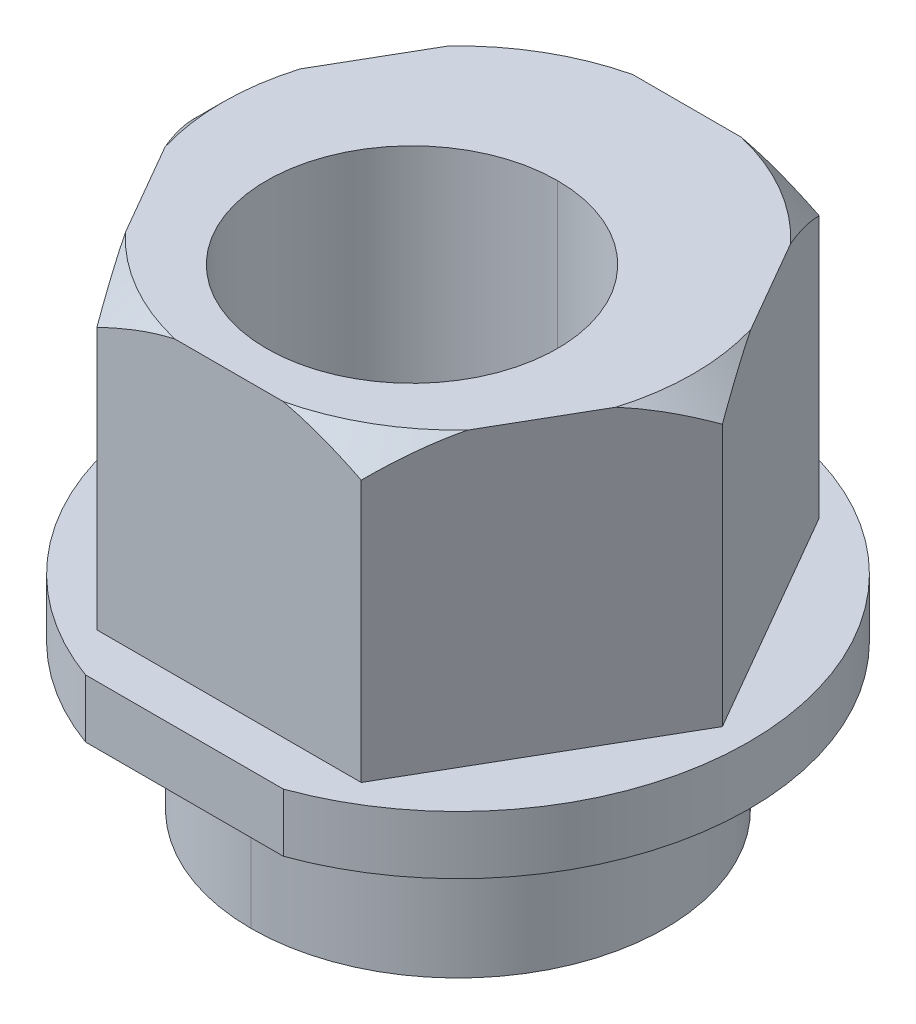
ISO-10303-21;
HEADER;
FILE_DESCRIPTION(('STEP AP214'),'2;1');
FILE_NAME('part.step','',(''),(''),'','','');
FILE_SCHEMA(('AUTOMOTIVE_DESIGN { 1 0 10303 214 1 1 1 1 }'));
ENDSEC;
DATA;
#1=APPLICATION_CONTEXT('core data for automotive mechanical design processes');
#2=APPLICATION_PROTOCOL_DEFINITION('international standard','automotive_design',2000,#1);
#3=PRODUCT_CONTEXT('',#1,'mechanical');
#4=PRODUCT('Part','Part','',(#3));
#5=PRODUCT_RELATED_PRODUCT_CATEGORY('part','',(#4));
#6=PRODUCT_DEFINITION_FORMATION('','',#4);
#7=PRODUCT_DEFINITION_CONTEXT('part definition',#1,'design');
#8=PRODUCT_DEFINITION('design','',#6,#7);
#9=PRODUCT_DEFINITION_SHAPE('','',#8);
#10=(LENGTH_UNIT() NAMED_UNIT(*) SI_UNIT(.MILLI.,.METRE.));
#11=(NAMED_UNIT(*) PLANE_ANGLE_UNIT() SI_UNIT($,.RADIAN.));
#12=(NAMED_UNIT(*) SI_UNIT($,.STERADIAN.) SOLID_ANGLE_UNIT());
#13=UNCERTAINTY_MEASURE_WITH_UNIT(LENGTH_MEASURE(1.E-05),#10,'distance_accuracy_value','');
#14=(GEOMETRIC_REPRESENTATION_CONTEXT(3) GLOBAL_UNCERTAINTY_ASSIGNED_CONTEXT((#13)) GLOBAL_UNIT_ASSIGNED_CONTEXT((#10,
#11,#12)) REPRESENTATION_CONTEXT('',''));
#15=CARTESIAN_POINT('',(0.,0.,0.));
#16=DIRECTION('',(0.,0.,1.));
#17=DIRECTION('',(1.,0.,0.));
#18=AXIS2_PLACEMENT_3D('',#15,#16,#17);
#19=CARTESIAN_POINT('',(0.,5.,0.));
#20=DIRECTION('',(0.,-1.,0.));
#21=DIRECTION('',(0.,0.,-1.));
#22=AXIS2_PLACEMENT_3D('',#19,#20,#21);
#23=CONICAL_SURFACE('',#22,4.04374661852235,0.785398163397448);
#24=CARTESIAN_POINT('',(-0.931483609523519,5.,3.935));
#25=CARTESIAN_POINT('',(-1.56265689446236,4.8546082073994,3.935));
#26=CARTESIAN_POINT('',(-2.27187330926117,4.5,3.935));
#27=B_SPLINE_CURVE_WITH_KNOTS('',2,(#24,#25,#26),.UNSPECIFIED.,.F.,.F.,(3,3),(0.,1.),.UNSPECIFIED.);
#28=CARTESIAN_POINT('',(-0.931483609523519,5.,3.935));
#29=VERTEX_POINT('',#28);
#30=CARTESIAN_POINT('',(-2.27187330926118,4.5,3.935));
#31=VERTEX_POINT('',#30);
#32=EDGE_CURVE('E227',#29,#31,#27,.T.);
#33=ORIENTED_EDGE('',*,*,#32,.F.);
#34=CARTESIAN_POINT('',(0.,5.,0.));
#35=DIRECTION('',(0.,-1.,0.));
#36=DIRECTION('',(0.,0.,1.));
#37=AXIS2_PLACEMENT_3D('',#34,#35,#36);
#38=CIRCLE('',#37,4.04374661852235);
#39=CARTESIAN_POINT('',(-2.94206815913001,5.,2.77418846905619));
#40=VERTEX_POINT('',#39);
#41=EDGE_CURVE('E226',#29,#40,#38,.T.);
#42=ORIENTED_EDGE('',*,*,#41,.T.);
#43=CARTESIAN_POINT('',(-2.27187330926117,4.5,3.93500000000001));
#44=CARTESIAN_POINT('',(-2.62648151666057,4.85460820739939,3.32080056800333));
#45=CARTESIAN_POINT('',(-2.94206815913,5.,2.7741884690562));
#46=B_SPLINE_CURVE_WITH_KNOTS('',2,(#43,#44,#45),.UNSPECIFIED.,.F.,.F.,(3,3),(0.,1.),.UNSPECIFIED.);
#47=EDGE_CURVE('E581',#31,#40,#46,.T.);
#48=ORIENTED_EDGE('',*,*,#47,.F.);
#49=EDGE_LOOP('',(#33,#42,#48));
#50=FACE_BOUND('',#49,.T.);
#51=ADVANCED_FACE('F16',(#50),#23,.T.);
#52=CARTESIAN_POINT('',(0.,5.,0.));
#53=DIRECTION('',(0.,-1.,0.));
#54=DIRECTION('',(0.,0.,-1.));
#55=AXIS2_PLACEMENT_3D('',#52,#53,#54);
#56=CONICAL_SURFACE('',#55,4.04374661852235,0.785398163397448);
#57=CARTESIAN_POINT('',(-3.87355176865352,5.,1.16081153094381));
#58=CARTESIAN_POINT('',(-4.189138411123,4.8546082073994,0.614199431996595));
#59=CARTESIAN_POINT('',(-4.54374661852235,4.5,0.));
#60=B_SPLINE_CURVE_WITH_KNOTS('',2,(#57,#58,#59),.UNSPECIFIED.,.F.,.F.,(3,3),(0.,1.),.UNSPECIFIED.);
#61=CARTESIAN_POINT('',(-3.87355176865353,5.,1.16081153094381));
#62=VERTEX_POINT('',#61);
#63=CARTESIAN_POINT('',(-4.54374661852235,4.5,0.));
#64=VERTEX_POINT('',#63);
#65=EDGE_CURVE('E202',#62,#64,#60,.T.);
#66=ORIENTED_EDGE('',*,*,#65,.F.);
#67=CARTESIAN_POINT('',(0.,5.,0.));
#68=DIRECTION('',(0.,-1.,0.));
#69=DIRECTION('',(0.,0.,1.));
#70=AXIS2_PLACEMENT_3D('',#67,#68,#69);
#71=CIRCLE('',#70,4.04374661852235);
#72=CARTESIAN_POINT('',(-3.87355176865353,5.,-1.1608115309438));
#73=VERTEX_POINT('',#72);
#74=EDGE_CURVE('E256',#62,#73,#71,.T.);
#75=ORIENTED_EDGE('',*,*,#74,.T.);
#76=CARTESIAN_POINT('',(-4.54374661852235,4.5,0.));
#77=CARTESIAN_POINT('',(-4.18913841112296,4.85460820739939,-0.614199431996668));
#78=CARTESIAN_POINT('',(-3.87355176865352,5.,-1.1608115309438));
#79=B_SPLINE_CURVE_WITH_KNOTS('',2,(#76,#77,#78),.UNSPECIFIED.,.F.,.F.,(3,3),(0.,1.),.UNSPECIFIED.);
#80=EDGE_CURVE('E416',#64,#73,#79,.T.);
#81=ORIENTED_EDGE('',*,*,#80,.F.);
#82=EDGE_LOOP('',(#66,#75,#81));
#83=FACE_BOUND('',#82,.T.);
#84=ADVANCED_FACE('F295',(#83),#56,.T.);
#85=CARTESIAN_POINT('',(0.,5.,0.));
#86=DIRECTION('',(0.,-1.,0.));
#87=DIRECTION('',(0.,0.,-1.));
#88=AXIS2_PLACEMENT_3D('',#85,#86,#87);
#89=CONICAL_SURFACE('',#88,4.04374661852235,0.785398163397448);
#90=CARTESIAN_POINT('',(-2.94206815913,5.,-2.7741884690562));
#91=CARTESIAN_POINT('',(-2.62648151666052,4.85460820739939,-3.32080056800342));
#92=CARTESIAN_POINT('',(-2.27187330926117,4.5,-3.935));
#93=B_SPLINE_CURVE_WITH_KNOTS('',2,(#90,#91,#92),.UNSPECIFIED.,.F.,.F.,(3,3),(0.,1.),.UNSPECIFIED.);
#94=CARTESIAN_POINT('',(-2.94206815913,5.,-2.7741884690562));
#95=VERTEX_POINT('',#94);
#96=CARTESIAN_POINT('',(-2.27187330926118,4.5,-3.935));
#97=VERTEX_POINT('',#96);
#98=EDGE_CURVE('E267',#95,#97,#93,.T.);
#99=ORIENTED_EDGE('',*,*,#98,.F.);
#100=CARTESIAN_POINT('',(0.,5.,0.));
#101=DIRECTION('',(0.,-1.,0.));
#102=DIRECTION('',(0.,0.,1.));
#103=AXIS2_PLACEMENT_3D('',#100,#101,#102);
#104=CIRCLE('',#103,4.04374661852235);
#105=CARTESIAN_POINT('',(-0.931483609523527,5.,-3.935));
#106=VERTEX_POINT('',#105);
#107=EDGE_CURVE('E441',#95,#106,#104,.T.);
#108=ORIENTED_EDGE('',*,*,#107,.T.);
#109=CARTESIAN_POINT('',(-2.27187330926118,4.5,-3.935));
#110=CARTESIAN_POINT('',(-2.05765354420189,4.60710988252965,-3.935));
#111=CARTESIAN_POINT('',(-1.83776180733292,4.7056620232674,-3.935));
#112=CARTESIAN_POINT('',(-1.39148615565716,4.87507258275483,-3.935));
#113=CARTESIAN_POINT('',(-1.16421686751143,4.94638951555142,-3.935));
#114=CARTESIAN_POINT('',(-0.931483609523527,5.,-3.935));
#115=(BOUNDED_CURVE() B_SPLINE_CURVE(3,(#109,#110,#111,#112,#113,#114),.UNSPECIFIED.,.F.,
.F.) B_SPLINE_CURVE_WITH_KNOTS((4,2,4),(0.00329753197333184,0.00401123106866075,
0.00472493016398966),
.UNSPECIFIED.) CURVE() GEOMETRIC_REPRESENTATION_ITEM() RATIONAL_B_SPLINE_CURVE((1.,1.,1.,1.,1.,1.)) REPRESENTATION_ITEM(''));
#116=EDGE_CURVE('E421',#97,#106,#115,.T.);
#117=ORIENTED_EDGE('',*,*,#116,.F.);
#118=EDGE_LOOP('',(#99,#108,#117));
#119=FACE_BOUND('',#118,.T.);
#120=ADVANCED_FACE('F298',(#119),#89,.T.);
#121=CARTESIAN_POINT('',(0.,5.,0.));
#122=DIRECTION('',(0.,-1.,0.));
#123=DIRECTION('',(0.,0.,-1.));
#124=AXIS2_PLACEMENT_3D('',#121,#122,#123);
#125=CONICAL_SURFACE('',#124,4.04374661852235,0.785398163397448);
#126=CARTESIAN_POINT('',(0.931483609523525,5.,-3.935));
#127=CARTESIAN_POINT('',(1.56265689446236,4.85460820739941,-3.935));
#128=CARTESIAN_POINT('',(2.27187330926118,4.5,-3.935));
#129=B_SPLINE_CURVE_WITH_KNOTS('',2,(#126,#127,#128),.UNSPECIFIED.,.F.,.F.,(3,3),(0.,1.),.UNSPECIFIED.);
#130=CARTESIAN_POINT('',(0.931483609523526,5.,-3.935));
#131=VERTEX_POINT('',#130);
#132=CARTESIAN_POINT('',(2.27187330926118,4.5,-3.935));
#133=VERTEX_POINT('',#132);
#134=EDGE_CURVE('E233',#131,#133,#129,.T.);
#135=ORIENTED_EDGE('',*,*,#134,.F.);
#136=CARTESIAN_POINT('',(0.,5.,0.));
#137=DIRECTION('',(0.,-1.,0.));
#138=DIRECTION('',(0.,0.,-1.));
#139=AXIS2_PLACEMENT_3D('',#136,#137,#138);
#140=CIRCLE('',#139,4.04374661852235);
#141=CARTESIAN_POINT('',(2.94206815913,5.,-2.7741884690562));
#142=VERTEX_POINT('',#141);
#143=EDGE_CURVE('E443',#131,#142,#140,.T.);
#144=ORIENTED_EDGE('',*,*,#143,.T.);
#145=CARTESIAN_POINT('',(2.27187330926118,4.5,-3.93499999999999));
#146=CARTESIAN_POINT('',(2.62648151666057,4.85460820739939,-3.32080056800333));
#147=CARTESIAN_POINT('',(2.94206815913,5.,-2.7741884690562));
#148=B_SPLINE_CURVE_WITH_KNOTS('',2,(#145,#146,#147),.UNSPECIFIED.,.F.,.F.,(3,3),(0.,1.),.UNSPECIFIED.);
#149=EDGE_CURVE('E518',#133,#142,#148,.T.);
#150=ORIENTED_EDGE('',*,*,#149,.F.);
#151=EDGE_LOOP('',(#135,#144,#150));
#152=FACE_BOUND('',#151,.T.);
#153=ADVANCED_FACE('F292',(#152),#125,.T.);
#154=CARTESIAN_POINT('',(0.,5.,0.));
#155=DIRECTION('',(0.,-1.,0.));
#156=DIRECTION('',(0.,0.,-1.));
#157=AXIS2_PLACEMENT_3D('',#154,#155,#156);
#158=CONICAL_SURFACE('',#157,4.04374661852235,0.785398163397448);
#159=CARTESIAN_POINT('',(3.87355176865352,5.,-1.1608115309438));
#160=CARTESIAN_POINT('',(4.18913841112301,4.85460820739939,-0.614199431996586));
#161=CARTESIAN_POINT('',(4.54374661852235,4.5,0.));
#162=B_SPLINE_CURVE_WITH_KNOTS('',2,(#159,#160,#161),.UNSPECIFIED.,.F.,.F.,(3,3),(0.,1.),.UNSPECIFIED.);
#163=CARTESIAN_POINT('',(3.87355176865353,5.,-1.1608115309438));
#164=VERTEX_POINT('',#163);
#165=CARTESIAN_POINT('',(4.54374661852235,4.5,0.));
#166=VERTEX_POINT('',#165);
#167=EDGE_CURVE('E208',#164,#166,#162,.T.);
#168=ORIENTED_EDGE('',*,*,#167,.F.);
#169=CARTESIAN_POINT('',(0.,5.,0.));
#170=DIRECTION('',(0.,-1.,0.));
#171=DIRECTION('',(0.,0.,1.));
#172=AXIS2_PLACEMENT_3D('',#169,#170,#171);
#173=CIRCLE('',#172,4.04374661852235);
#174=CARTESIAN_POINT('',(3.87355176865353,5.,1.1608115309438));
#175=VERTEX_POINT('',#174);
#176=EDGE_CURVE('E497',#164,#175,#173,.T.);
#177=ORIENTED_EDGE('',*,*,#176,.T.);
#178=CARTESIAN_POINT('',(4.54374661852235,4.5,0.));
#179=CARTESIAN_POINT('',(4.18913841112296,4.85460820739938,0.614199431996659));
#180=CARTESIAN_POINT('',(3.87355176865353,5.,1.1608115309438));
#181=B_SPLINE_CURVE_WITH_KNOTS('',2,(#178,#179,#180),.UNSPECIFIED.,.F.,.F.,(3,3),(0.,1.),.UNSPECIFIED.);
#182=EDGE_CURVE('E494',#166,#175,#181,.T.);
#183=ORIENTED_EDGE('',*,*,#182,.F.);
#184=EDGE_LOOP('',(#168,#177,#183));
#185=FACE_BOUND('',#184,.T.);
#186=ADVANCED_FACE('F300',(#185),#158,.T.);
#187=CARTESIAN_POINT('',(0.,5.,0.));
#188=DIRECTION('',(0.,-1.,0.));
#189=DIRECTION('',(0.,0.,-1.));
#190=AXIS2_PLACEMENT_3D('',#187,#188,#189);
#191=CONICAL_SURFACE('',#190,4.04374661852235,0.785398163397448);
#192=CARTESIAN_POINT('',(0.,5.,0.));
#193=DIRECTION('',(0.,-1.,0.));
#194=DIRECTION('',(0.,0.,1.));
#195=AXIS2_PLACEMENT_3D('',#192,#193,#194);
#196=CIRCLE('',#195,4.04374661852235);
#197=CARTESIAN_POINT('',(2.94206815913,5.,2.7741884690562));
#198=VERTEX_POINT('',#197);
#199=CARTESIAN_POINT('',(0.931483609523519,5.,3.935));
#200=VERTEX_POINT('',#199);
#201=EDGE_CURVE('E660',#198,#200,#196,.T.);
#202=ORIENTED_EDGE('',*,*,#201,.T.);
#203=CARTESIAN_POINT('',(2.27187330926118,4.5,3.935));
#204=CARTESIAN_POINT('',(2.05765354420189,4.60710988252965,3.935));
#205=CARTESIAN_POINT('',(1.83776180733291,4.7056620232674,3.935));
#206=CARTESIAN_POINT('',(1.39148615565715,4.87507258275483,3.935));
#207=CARTESIAN_POINT('',(1.16421686751142,4.94638951555142,3.935));
#208=CARTESIAN_POINT('',(0.931483609523519,5.,3.935));
#209=(BOUNDED_CURVE() B_SPLINE_CURVE(3,(#203,#204,#205,#206,#207,#208),.UNSPECIFIED.,.F.,
.F.) B_SPLINE_CURVE_WITH_KNOTS((4,2,4),(0.00329753197333185,0.00401123106866076,
0.00472493016398966),
.UNSPECIFIED.) CURVE() GEOMETRIC_REPRESENTATION_ITEM() RATIONAL_B_SPLINE_CURVE((1.,1.,1.,1.,1.,1.)) REPRESENTATION_ITEM(''));
#210=CARTESIAN_POINT('',(2.27187330926118,4.5,3.935));
#211=VERTEX_POINT('',#210);
#212=EDGE_CURVE('E201',#211,#200,#209,.T.);
#213=ORIENTED_EDGE('',*,*,#212,.F.);
#214=CARTESIAN_POINT('',(2.94206815913,5.,2.7741884690562));
#215=CARTESIAN_POINT('',(2.62648151666052,4.85460820739939,3.32080056800341));
#216=CARTESIAN_POINT('',(2.27187330926117,4.5,3.935));
#217=B_SPLINE_CURVE_WITH_KNOTS('',2,(#214,#215,#216),.UNSPECIFIED.,.F.,.F.,(3,3),(0.,1.),.UNSPECIFIED.);
#218=EDGE_CURVE('E538',#198,#211,#217,.T.);
#219=ORIENTED_EDGE('',*,*,#218,.F.);
#220=EDGE_LOOP('',(#202,#213,#219));
#221=FACE_BOUND('',#220,.T.);
#222=ADVANCED_FACE('F355',(#221),#191,.T.);
#223=CARTESIAN_POINT('',(-1.7,-3.5,4.7021271782035));
#224=DIRECTION('',(0.,0.,-1.));
#225=DIRECTION('',(0.,-1.,0.));
#226=AXIS2_PLACEMENT_3D('',#223,#224,#225);
#227=PLANE('',#226);
#228=DIRECTION('',(0.,1.,0.));
#229=VECTOR('',#228,1.);
#230=CARTESIAN_POINT('',(1.7,-1.,4.7021271782035));
#231=LINE('',#230,#229);
#232=CARTESIAN_POINT('',(1.7,-1.,4.7021271782035));
#233=VERTEX_POINT('',#232);
#234=CARTESIAN_POINT('',(1.7,0.,4.7021271782035));
#235=VERTEX_POINT('',#234);
#236=EDGE_CURVE('E211',#233,#235,#231,.T.);
#237=ORIENTED_EDGE('',*,*,#236,.T.);
#238=DIRECTION('',(-1.,0.,0.));
#239=VECTOR('',#238,1.);
#240=CARTESIAN_POINT('',(-1.7,0.,4.7021271782035));
#241=LINE('',#240,#239);
#242=CARTESIAN_POINT('',(-1.7,0.,4.7021271782035));
#243=VERTEX_POINT('',#242);
#244=EDGE_CURVE('E234',#235,#243,#241,.T.);
#245=ORIENTED_EDGE('',*,*,#244,.T.);
#246=DIRECTION('',(0.,-1.,0.));
#247=VECTOR('',#246,1.);
#248=CARTESIAN_POINT('',(-1.7,-1.,4.7021271782035));
#249=LINE('',#248,#247);
#250=CARTESIAN_POINT('',(-1.7,-1.,4.7021271782035));
#251=VERTEX_POINT('',#250);
#252=EDGE_CURVE('E44',#243,#251,#249,.T.);
#253=ORIENTED_EDGE('',*,*,#252,.T.);
#254=DIRECTION('',(-1.,0.,0.));
#255=VECTOR('',#254,1.);
#256=CARTESIAN_POINT('',(0.,-1.,4.7021271782035));
#257=LINE('',#256,#255);
#258=EDGE_CURVE('E172',#233,#251,#257,.T.);
#259=ORIENTED_EDGE('',*,*,#258,.F.);
#260=EDGE_LOOP('',(#237,#245,#253,#259));
#261=FACE_BOUND('',#260,.T.);
#262=ADVANCED_FACE('F18',(#261),#227,.F.);
#263=CARTESIAN_POINT('',(0.,-3.5,0.79));
#264=DIRECTION('',(0.,1.,0.));
#265=DIRECTION('',(0.,0.,1.));
#266=AXIS2_PLACEMENT_3D('',#263,#264,#265);
#267=CYLINDRICAL_SURFACE('',#266,2.5);
#268=DIRECTION('',(0.,1.,0.));
#269=VECTOR('',#268,1.);
#270=CARTESIAN_POINT('',(0.,-3.5,-1.71));
#271=LINE('',#270,#269);
#272=CARTESIAN_POINT('',(0.,-3.5,-1.71));
#273=VERTEX_POINT('',#272);
#274=CARTESIAN_POINT('',(0.,5.,-1.71));
#275=VERTEX_POINT('',#274);
#276=EDGE_CURVE('E218',#273,#275,#271,.T.);
#277=ORIENTED_EDGE('',*,*,#276,.F.);
#278=CARTESIAN_POINT('',(0.,-3.5,0.79));
#279=DIRECTION('',(0.,1.,0.));
#280=DIRECTION('',(0.,0.,1.));
#281=AXIS2_PLACEMENT_3D('',#278,#279,#280);
#282=CIRCLE('',#281,2.5);
#283=CARTESIAN_POINT('',(0.,-3.5,3.29));
#284=VERTEX_POINT('',#283);
#285=EDGE_CURVE('E11',#284,#273,#282,.T.);
#286=ORIENTED_EDGE('',*,*,#285,.F.);
#287=DIRECTION('',(0.,1.,0.));
#288=VECTOR('',#287,1.);
#289=CARTESIAN_POINT('',(0.,-3.5,3.29));
#290=LINE('',#289,#288);
#291=CARTESIAN_POINT('',(0.,5.,3.29));
#292=VERTEX_POINT('',#291);
#293=EDGE_CURVE('E213',#284,#292,#290,.T.);
#294=ORIENTED_EDGE('',*,*,#293,.T.);
#295=CARTESIAN_POINT('',(0.,5.,0.79));
#296=DIRECTION('',(0.,1.,0.));
#297=DIRECTION('',(0.,0.,1.));
#298=AXIS2_PLACEMENT_3D('',#295,#296,#297);
#299=CIRCLE('',#298,2.5);
#300=EDGE_CURVE('E239',#292,#275,#299,.T.);
#301=ORIENTED_EDGE('',*,*,#300,.T.);
#302=EDGE_LOOP('',(#277,#286,#294,#301));
#303=FACE_BOUND('',#302,.T.);
#304=ADVANCED_FACE('F345',(#303),#267,.F.);
#305=CARTESIAN_POINT('',(0.,-3.5,0.));
#306=DIRECTION('',(0.,-1.,0.));
#307=DIRECTION('',(0.,0.,-1.));
#308=AXIS2_PLACEMENT_3D('',#305,#306,#307);
#309=PLANE('',#308);
#310=ORIENTED_EDGE('',*,*,#285,.T.);
#311=CARTESIAN_POINT('',(0.,-3.5,0.79));
#312=DIRECTION('',(0.,1.,0.));
#313=DIRECTION('',(0.,0.,1.));
#314=AXIS2_PLACEMENT_3D('',#311,#312,#313);
#315=CIRCLE('',#314,2.5);
#316=EDGE_CURVE('E215',#273,#284,#315,.T.);
#317=ORIENTED_EDGE('',*,*,#316,.T.);
#318=EDGE_LOOP('',(#310,#317));
#319=FACE_BOUND('',#318,.T.);
#320=CARTESIAN_POINT('',(0.,-3.5,0.));
#321=DIRECTION('',(0.,-1.,0.));
#322=DIRECTION('',(0.,0.,-1.));
#323=AXIS2_PLACEMENT_3D('',#320,#321,#322);
#324=CIRCLE('',#323,3.555);
#325=CARTESIAN_POINT('',(0.,-3.5,3.555));
#326=VERTEX_POINT('',#325);
#327=CARTESIAN_POINT('',(0.,-3.5,-3.555));
#328=VERTEX_POINT('',#327);
#329=EDGE_CURVE('E29',#326,#328,#324,.T.);
#330=ORIENTED_EDGE('',*,*,#329,.T.);
#331=CARTESIAN_POINT('',(0.,-3.5,0.));
#332=DIRECTION('',(0.,-1.,0.));
#333=DIRECTION('',(0.,0.,-1.));
#334=AXIS2_PLACEMENT_3D('',#331,#332,#333);
#335=CIRCLE('',#334,3.555);
#336=EDGE_CURVE('E192',#328,#326,#335,.T.);
#337=ORIENTED_EDGE('',*,*,#336,.T.);
#338=EDGE_LOOP('',(#330,#337));
#339=FACE_BOUND('',#338,.T.);
#340=ADVANCED_FACE('F347',(#319,#339),#309,.T.);
#341=CARTESIAN_POINT('',(0.,-3.5,0.));
#342=DIRECTION('',(0.,1.,0.));
#343=DIRECTION('',(0.,0.,1.));
#344=AXIS2_PLACEMENT_3D('',#341,#342,#343);
#345=CYLINDRICAL_SURFACE('',#344,3.555);
#346=DIRECTION('',(0.,1.,0.));
#347=VECTOR('',#346,1.);
#348=CARTESIAN_POINT('',(0.,-3.5,-3.555));
#349=LINE('',#348,#347);
#350=CARTESIAN_POINT('',(0.,-1.,-3.555));
#351=VERTEX_POINT('',#350);
#352=EDGE_CURVE('E186',#328,#351,#349,.T.);
#353=ORIENTED_EDGE('',*,*,#352,.F.);
#354=ORIENTED_EDGE('',*,*,#329,.F.);
#355=DIRECTION('',(0.,1.,0.));
#356=VECTOR('',#355,1.);
#357=CARTESIAN_POINT('',(0.,-3.5,3.555));
#358=LINE('',#357,#356);
#359=CARTESIAN_POINT('',(0.,-1.,3.555));
#360=VERTEX_POINT('',#359);
#361=EDGE_CURVE('E176',#326,#360,#358,.T.);
#362=ORIENTED_EDGE('',*,*,#361,.T.);
#363=CARTESIAN_POINT('',(0.,-1.,0.));
#364=DIRECTION('',(0.,-1.,0.));
#365=DIRECTION('',(0.,0.,1.));
#366=AXIS2_PLACEMENT_3D('',#363,#364,#365);
#367=CIRCLE('',#366,3.555);
#368=EDGE_CURVE('E161',#360,#351,#367,.T.);
#369=ORIENTED_EDGE('',*,*,#368,.T.);
#370=EDGE_LOOP('',(#353,#354,#362,#369));
#371=FACE_BOUND('',#370,.T.);
#372=ADVANCED_FACE('F177',(#371),#345,.T.);
#373=CARTESIAN_POINT('',(0.,-1.,0.));
#374=DIRECTION('',(0.,1.,0.));
#375=DIRECTION('',(0.,0.,1.));
#376=AXIS2_PLACEMENT_3D('',#373,#374,#375);
#377=CYLINDRICAL_SURFACE('',#376,5.);
#378=ORIENTED_EDGE('',*,*,#252,.F.);
#379=CARTESIAN_POINT('',(0.,0.,0.));
#380=DIRECTION('',(0.,1.,0.));
#381=DIRECTION('',(0.,0.,1.));
#382=AXIS2_PLACEMENT_3D('',#379,#380,#381);
#383=CIRCLE('',#382,5.);
#384=EDGE_CURVE('E238',#235,#243,#383,.T.);
#385=ORIENTED_EDGE('',*,*,#384,.F.);
#386=ORIENTED_EDGE('',*,*,#236,.F.);
#387=CARTESIAN_POINT('',(0.,-1.,0.));
#388=DIRECTION('',(0.,1.,0.));
#389=DIRECTION('',(0.,0.,1.));
#390=AXIS2_PLACEMENT_3D('',#387,#388,#389);
#391=CIRCLE('',#390,5.);
#392=EDGE_CURVE('E183',#233,#251,#391,.T.);
#393=ORIENTED_EDGE('',*,*,#392,.T.);
#394=EDGE_LOOP('',(#378,#385,#386,#393));
#395=FACE_BOUND('',#394,.T.);
#396=ADVANCED_FACE('F471',(#395),#377,.T.);
#397=CARTESIAN_POINT('',(0.,0.,0.));
#398=DIRECTION('',(0.,1.,0.));
#399=DIRECTION('',(1.,0.,0.));
#400=AXIS2_PLACEMENT_3D('',#397,#398,#399);
#401=PLANE('',#400);
#402=DIRECTION('',(0.5,0.,-0.866025403784439));
#403=VECTOR('',#402,1.);
#404=CARTESIAN_POINT('',(2.27187330926118,0.,3.935));
#405=LINE('',#404,#403);
#406=CARTESIAN_POINT('',(2.27187330926118,0.,3.935));
#407=VERTEX_POINT('',#406);
#408=CARTESIAN_POINT('',(4.54374661852235,0.,0.));
#409=VERTEX_POINT('',#408);
#410=EDGE_CURVE('E196',#407,#409,#405,.T.);
#411=ORIENTED_EDGE('',*,*,#410,.F.);
#412=DIRECTION('',(1.,0.,0.));
#413=VECTOR('',#412,1.);
#414=CARTESIAN_POINT('',(-2.27187330926118,0.,3.935));
#415=LINE('',#414,#413);
#416=CARTESIAN_POINT('',(-2.27187330926118,0.,3.935));
#417=VERTEX_POINT('',#416);
#418=EDGE_CURVE('E223',#417,#407,#415,.T.);
#419=ORIENTED_EDGE('',*,*,#418,.F.);
#420=DIRECTION('',(0.5,0.,0.866025403784439));
#421=VECTOR('',#420,1.);
#422=CARTESIAN_POINT('',(-4.54374661852235,0.,0.));
#423=LINE('',#422,#421);
#424=CARTESIAN_POINT('',(-4.54374661852235,0.,0.));
#425=VERTEX_POINT('',#424);
#426=EDGE_CURVE('E197',#425,#417,#423,.T.);
#427=ORIENTED_EDGE('',*,*,#426,.F.);
#428=DIRECTION('',(-0.5,0.,0.866025403784439));
#429=VECTOR('',#428,1.);
#430=CARTESIAN_POINT('',(-2.27187330926118,0.,-3.935));
#431=LINE('',#430,#429);
#432=CARTESIAN_POINT('',(-2.27187330926118,0.,-3.935));
#433=VERTEX_POINT('',#432);
#434=EDGE_CURVE('E262',#433,#425,#431,.T.);
#435=ORIENTED_EDGE('',*,*,#434,.F.);
#436=DIRECTION('',(-1.,0.,0.));
#437=VECTOR('',#436,1.);
#438=CARTESIAN_POINT('',(2.27187330926118,0.,-3.935));
#439=LINE('',#438,#437);
#440=CARTESIAN_POINT('',(2.27187330926118,0.,-3.935));
#441=VERTEX_POINT('',#440);
#442=EDGE_CURVE('E228',#441,#433,#439,.T.);
#443=ORIENTED_EDGE('',*,*,#442,.F.);
#444=DIRECTION('',(-0.5,0.,-0.866025403784438));
#445=VECTOR('',#444,1.);
#446=CARTESIAN_POINT('',(4.54374661852235,0.,0.));
#447=LINE('',#446,#445);
#448=EDGE_CURVE('E203',#409,#441,#447,.T.);
#449=ORIENTED_EDGE('',*,*,#448,.F.);
#450=EDGE_LOOP('',(#411,#419,#427,#435,#443,#449));
#451=FACE_BOUND('',#450,.T.);
#452=ORIENTED_EDGE('',*,*,#244,.F.);
#453=ORIENTED_EDGE('',*,*,#384,.T.);
#454=EDGE_LOOP('',(#452,#453));
#455=FACE_BOUND('',#454,.T.);
#456=ADVANCED_FACE('F402',(#451,#455),#401,.T.);
#457=CARTESIAN_POINT('',(0.,5.,0.));
#458=DIRECTION('',(0.,1.,0.));
#459=DIRECTION('',(1.,0.,0.));
#460=AXIS2_PLACEMENT_3D('',#457,#458,#459);
#461=PLANE('',#460);
#462=ORIENTED_EDGE('',*,*,#300,.F.);
#463=CARTESIAN_POINT('',(0.,5.,0.79));
#464=DIRECTION('',(0.,1.,0.));
#465=DIRECTION('',(0.,0.,1.));
#466=AXIS2_PLACEMENT_3D('',#463,#464,#465);
#467=CIRCLE('',#466,2.5);
#468=EDGE_CURVE('E245',#275,#292,#467,.T.);
#469=ORIENTED_EDGE('',*,*,#468,.F.);
#470=EDGE_LOOP('',(#462,#469));
#471=FACE_BOUND('',#470,.T.);
#472=ORIENTED_EDGE('',*,*,#41,.F.);
#473=DIRECTION('',(1.,0.,0.));
#474=VECTOR('',#473,1.);
#475=CARTESIAN_POINT('',(-2.27187330926118,5.,3.935));
#476=LINE('',#475,#474);
#477=EDGE_CURVE('E560',#29,#200,#476,.T.);
#478=ORIENTED_EDGE('',*,*,#477,.T.);
#479=ORIENTED_EDGE('',*,*,#201,.F.);
#480=DIRECTION('',(0.5,0.,-0.866025403784439));
#481=VECTOR('',#480,1.);
#482=CARTESIAN_POINT('',(2.27187330926118,5.,3.935));
#483=LINE('',#482,#481);
#484=EDGE_CURVE('E501',#198,#175,#483,.T.);
#485=ORIENTED_EDGE('',*,*,#484,.T.);
#486=ORIENTED_EDGE('',*,*,#176,.F.);
#487=DIRECTION('',(-0.5,0.,-0.866025403784438));
#488=VECTOR('',#487,1.);
#489=CARTESIAN_POINT('',(4.54374661852235,5.,0.));
#490=LINE('',#489,#488);
#491=EDGE_CURVE('E634',#164,#142,#490,.T.);
#492=ORIENTED_EDGE('',*,*,#491,.T.);
#493=ORIENTED_EDGE('',*,*,#143,.F.);
#494=DIRECTION('',(-1.,0.,0.));
#495=VECTOR('',#494,1.);
#496=CARTESIAN_POINT('',(2.27187330926118,5.,-3.935));
#497=LINE('',#496,#495);
#498=EDGE_CURVE('E432',#131,#106,#497,.T.);
#499=ORIENTED_EDGE('',*,*,#498,.T.);
#500=ORIENTED_EDGE('',*,*,#107,.F.);
#501=DIRECTION('',(-0.5,0.,0.866025403784439));
#502=VECTOR('',#501,1.);
#503=CARTESIAN_POINT('',(-2.27187330926118,5.,-3.935));
#504=LINE('',#503,#502);
#505=EDGE_CURVE('E435',#95,#73,#504,.T.);
#506=ORIENTED_EDGE('',*,*,#505,.T.);
#507=ORIENTED_EDGE('',*,*,#74,.F.);
#508=DIRECTION('',(0.5,0.,0.866025403784439));
#509=VECTOR('',#508,1.);
#510=CARTESIAN_POINT('',(-4.54374661852235,5.,0.));
#511=LINE('',#510,#509);
#512=EDGE_CURVE('E616',#62,#40,#511,.T.);
#513=ORIENTED_EDGE('',*,*,#512,.T.);
#514=EDGE_LOOP('',(#472,#478,#479,#485,#486,#492,#493,#499,#500,#506,#507,#513));
#515=FACE_BOUND('',#514,.T.);
#516=ADVANCED_FACE('F291',(#471,#515),#461,.T.);
#517=CARTESIAN_POINT('',(-2.27187330926118,5.,3.935));
#518=DIRECTION('',(0.,0.,-1.));
#519=DIRECTION('',(0.,-1.,0.));
#520=AXIS2_PLACEMENT_3D('',#517,#518,#519);
#521=PLANE('',#520);
#522=DIRECTION('',(0.,-1.,0.));
#523=VECTOR('',#522,1.);
#524=CARTESIAN_POINT('',(2.27187330926118,5.,3.935));
#525=LINE('',#524,#523);
#526=EDGE_CURVE('E540',#211,#407,#525,.T.);
#527=ORIENTED_EDGE('',*,*,#526,.F.);
#528=ORIENTED_EDGE('',*,*,#212,.T.);
#529=ORIENTED_EDGE('',*,*,#477,.F.);
#530=ORIENTED_EDGE('',*,*,#32,.T.);
#531=DIRECTION('',(0.,-1.,0.));
#532=VECTOR('',#531,1.);
#533=CARTESIAN_POINT('',(-2.27187330926118,5.,3.935));
#534=LINE('',#533,#532);
#535=EDGE_CURVE('E266',#31,#417,#534,.T.);
#536=ORIENTED_EDGE('',*,*,#535,.T.);
#537=ORIENTED_EDGE('',*,*,#418,.T.);
#538=EDGE_LOOP('',(#527,#528,#529,#530,#536,#537));
#539=FACE_BOUND('',#538,.T.);
#540=ADVANCED_FACE('F280',(#539),#521,.F.);
#541=CARTESIAN_POINT('',(-4.54374661852235,5.,0.));
#542=DIRECTION('',(0.866025403784439,0.,-0.5));
#543=DIRECTION('',(0.,-1.,0.));
#544=AXIS2_PLACEMENT_3D('',#541,#542,#543);
#545=PLANE('',#544);
#546=ORIENTED_EDGE('',*,*,#535,.F.);
#547=ORIENTED_EDGE('',*,*,#47,.T.);
#548=ORIENTED_EDGE('',*,*,#512,.F.);
#549=ORIENTED_EDGE('',*,*,#65,.T.);
#550=DIRECTION('',(0.,-1.,0.));
#551=VECTOR('',#550,1.);
#552=CARTESIAN_POINT('',(-4.54374661852235,5.,0.));
#553=LINE('',#552,#551);
#554=EDGE_CURVE('E232',#64,#425,#553,.T.);
#555=ORIENTED_EDGE('',*,*,#554,.T.);
#556=ORIENTED_EDGE('',*,*,#426,.T.);
#557=EDGE_LOOP('',(#546,#547,#548,#549,#555,#556));
#558=FACE_BOUND('',#557,.T.);
#559=ADVANCED_FACE('F290',(#558),#545,.F.);
#560=CARTESIAN_POINT('',(-2.27187330926118,5.,-3.935));
#561=DIRECTION('',(0.866025403784439,0.,0.5));
#562=DIRECTION('',(0.,-1.,0.));
#563=AXIS2_PLACEMENT_3D('',#560,#561,#562);
#564=PLANE('',#563);
#565=ORIENTED_EDGE('',*,*,#554,.F.);
#566=ORIENTED_EDGE('',*,*,#80,.T.);
#567=ORIENTED_EDGE('',*,*,#505,.F.);
#568=ORIENTED_EDGE('',*,*,#98,.T.);
#569=DIRECTION('',(0.,-1.,0.));
#570=VECTOR('',#569,1.);
#571=CARTESIAN_POINT('',(-2.27187330926118,5.,-3.935));
#572=LINE('',#571,#570);
#573=EDGE_CURVE('E207',#97,#433,#572,.T.);
#574=ORIENTED_EDGE('',*,*,#573,.T.);
#575=ORIENTED_EDGE('',*,*,#434,.T.);
#576=EDGE_LOOP('',(#565,#566,#567,#568,#574,#575));
#577=FACE_BOUND('',#576,.T.);
#578=ADVANCED_FACE('F342',(#577),#564,.F.);
#579=CARTESIAN_POINT('',(2.27187330926118,5.,-3.935));
#580=DIRECTION('',(0.,0.,1.));
#581=DIRECTION('',(1.,0.,0.));
#582=AXIS2_PLACEMENT_3D('',#579,#580,#581);
#583=PLANE('',#582);
#584=ORIENTED_EDGE('',*,*,#573,.F.);
#585=ORIENTED_EDGE('',*,*,#116,.T.);
#586=ORIENTED_EDGE('',*,*,#498,.F.);
#587=ORIENTED_EDGE('',*,*,#134,.T.);
#588=DIRECTION('',(0.,-1.,0.));
#589=VECTOR('',#588,1.);
#590=CARTESIAN_POINT('',(2.27187330926118,5.,-3.935));
#591=LINE('',#590,#589);
#592=EDGE_CURVE('E628',#133,#441,#591,.T.);
#593=ORIENTED_EDGE('',*,*,#592,.T.);
#594=ORIENTED_EDGE('',*,*,#442,.T.);
#595=EDGE_LOOP('',(#584,#585,#586,#587,#593,#594));
#596=FACE_BOUND('',#595,.T.);
#597=ADVANCED_FACE('F332',(#596),#583,.F.);
#598=CARTESIAN_POINT('',(4.54374661852235,5.,0.));
#599=DIRECTION('',(-0.866025403784438,0.,0.5));
#600=DIRECTION('',(0.,1.,0.));
#601=AXIS2_PLACEMENT_3D('',#598,#599,#600);
#602=PLANE('',#601);
#603=ORIENTED_EDGE('',*,*,#592,.F.);
#604=ORIENTED_EDGE('',*,*,#149,.T.);
#605=ORIENTED_EDGE('',*,*,#491,.F.);
#606=ORIENTED_EDGE('',*,*,#167,.T.);
#607=DIRECTION('',(0.,-1.,0.));
#608=VECTOR('',#607,1.);
#609=CARTESIAN_POINT('',(4.54374661852235,5.,0.));
#610=LINE('',#609,#608);
#611=EDGE_CURVE('E171',#166,#409,#610,.T.);
#612=ORIENTED_EDGE('',*,*,#611,.T.);
#613=ORIENTED_EDGE('',*,*,#448,.T.);
#614=EDGE_LOOP('',(#603,#604,#605,#606,#612,#613));
#615=FACE_BOUND('',#614,.T.);
#616=ADVANCED_FACE('F341',(#615),#602,.F.);
#617=CARTESIAN_POINT('',(2.27187330926118,5.,3.935));
#618=DIRECTION('',(-0.866025403784439,0.,-0.5));
#619=DIRECTION('',(-0.5,0.,0.866025403784439));
#620=AXIS2_PLACEMENT_3D('',#617,#618,#619);
#621=PLANE('',#620);
#622=ORIENTED_EDGE('',*,*,#611,.F.);
#623=ORIENTED_EDGE('',*,*,#182,.T.);
#624=ORIENTED_EDGE('',*,*,#484,.F.);
#625=ORIENTED_EDGE('',*,*,#218,.T.);
#626=ORIENTED_EDGE('',*,*,#526,.T.);
#627=ORIENTED_EDGE('',*,*,#410,.T.);
#628=EDGE_LOOP('',(#622,#623,#624,#625,#626,#627));
#629=FACE_BOUND('',#628,.T.);
#630=ADVANCED_FACE('F457',(#629),#621,.F.);
#631=CARTESIAN_POINT('',(0.,-1.,0.));
#632=DIRECTION('',(0.,1.,0.));
#633=DIRECTION('',(1.,0.,0.));
#634=AXIS2_PLACEMENT_3D('',#631,#632,#633);
#635=PLANE('',#634);
#636=ORIENTED_EDGE('',*,*,#368,.F.);
#637=CARTESIAN_POINT('',(0.,-1.,0.));
#638=DIRECTION('',(0.,-1.,0.));
#639=DIRECTION('',(0.,0.,1.));
#640=AXIS2_PLACEMENT_3D('',#637,#638,#639);
#641=CIRCLE('',#640,3.555);
#642=EDGE_CURVE('E166',#351,#360,#641,.T.);
#643=ORIENTED_EDGE('',*,*,#642,.F.);
#644=EDGE_LOOP('',(#636,#643));
#645=FACE_BOUND('',#644,.T.);
#646=ORIENTED_EDGE('',*,*,#392,.F.);
#647=ORIENTED_EDGE('',*,*,#258,.T.);
#648=EDGE_LOOP('',(#646,#647));
#649=FACE_BOUND('',#648,.T.);
#650=ADVANCED_FACE('F163',(#645,#649),#635,.F.);
#651=CARTESIAN_POINT('',(0.,-3.5,0.));
#652=DIRECTION('',(0.,1.,0.));
#653=DIRECTION('',(0.,0.,1.));
#654=AXIS2_PLACEMENT_3D('',#651,#652,#653);
#655=CYLINDRICAL_SURFACE('',#654,3.555);
#656=ORIENTED_EDGE('',*,*,#336,.F.);
#657=ORIENTED_EDGE('',*,*,#352,.T.);
#658=ORIENTED_EDGE('',*,*,#642,.T.);
#659=ORIENTED_EDGE('',*,*,#361,.F.);
#660=EDGE_LOOP('',(#656,#657,#658,#659));
#661=FACE_BOUND('',#660,.T.);
#662=ADVANCED_FACE('F185',(#661),#655,.T.);
#663=CARTESIAN_POINT('',(0.,-3.5,0.79));
#664=DIRECTION('',(0.,1.,0.));
#665=DIRECTION('',(0.,0.,1.));
#666=AXIS2_PLACEMENT_3D('',#663,#664,#665);
#667=CYLINDRICAL_SURFACE('',#666,2.5);
#668=ORIENTED_EDGE('',*,*,#316,.F.);
#669=ORIENTED_EDGE('',*,*,#276,.T.);
#670=ORIENTED_EDGE('',*,*,#468,.T.);
#671=ORIENTED_EDGE('',*,*,#293,.F.);
#672=EDGE_LOOP('',(#668,#669,#670,#671));
#673=FACE_BOUND('',#672,.T.);
#674=ADVANCED_FACE('F455',(#673),#667,.F.);
#675=CLOSED_SHELL('',(#51,#84,#120,#153,#186,#222,#262,#304,#340,#372,#396,#456,#516,#540,#559,
#578,#597,#616,#630,#650,#662,#674));
#676=MANIFOLD_SOLID_BREP('B1',#675);
#677=ADVANCED_BREP_SHAPE_REPRESENTATION('',(#18,#676),#14);
#678=SHAPE_DEFINITION_REPRESENTATION(#9,#677);
ENDSEC;
END-ISO-10303-21;
